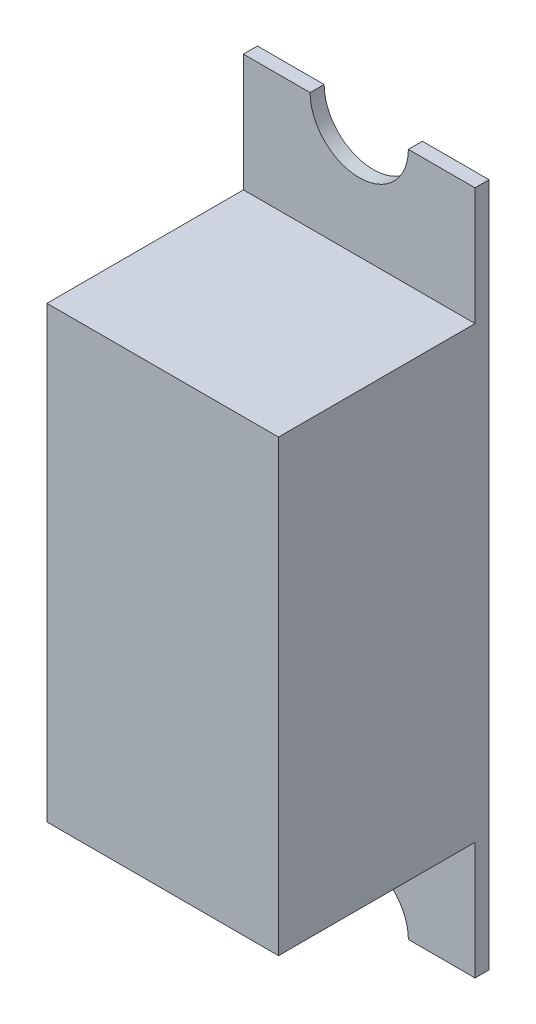
ISO-10303-21;
HEADER;
FILE_DESCRIPTION(('STEP AP214'),'2;1');
FILE_NAME('part.step','',(''),(''),'','','');
FILE_SCHEMA(('AUTOMOTIVE_DESIGN { 1 0 10303 214 1 1 1 1 }'));
ENDSEC;
DATA;
#1=APPLICATION_CONTEXT('core data for automotive mechanical design processes');
#2=APPLICATION_PROTOCOL_DEFINITION('international standard','automotive_design',2000,#1);
#3=PRODUCT_CONTEXT('',#1,'mechanical');
#4=PRODUCT('Part','Part','',(#3));
#5=PRODUCT_RELATED_PRODUCT_CATEGORY('part','',(#4));
#6=PRODUCT_DEFINITION_FORMATION('','',#4);
#7=PRODUCT_DEFINITION_CONTEXT('part definition',#1,'design');
#8=PRODUCT_DEFINITION('design','',#6,#7);
#9=PRODUCT_DEFINITION_SHAPE('','',#8);
#10=(LENGTH_UNIT() NAMED_UNIT(*) SI_UNIT(.MILLI.,.METRE.));
#11=(NAMED_UNIT(*) PLANE_ANGLE_UNIT() SI_UNIT($,.RADIAN.));
#12=(NAMED_UNIT(*) SI_UNIT($,.STERADIAN.) SOLID_ANGLE_UNIT());
#13=UNCERTAINTY_MEASURE_WITH_UNIT(LENGTH_MEASURE(1.E-05),#10,'distance_accuracy_value','');
#14=(GEOMETRIC_REPRESENTATION_CONTEXT(3) GLOBAL_UNCERTAINTY_ASSIGNED_CONTEXT((#13)) GLOBAL_UNIT_ASSIGNED_CONTEXT((#10,
#11,#12)) REPRESENTATION_CONTEXT('',''));
#15=CARTESIAN_POINT('',(0.,0.,0.));
#16=DIRECTION('',(0.,0.,1.));
#17=DIRECTION('',(1.,0.,0.));
#18=AXIS2_PLACEMENT_3D('',#15,#16,#17);
#19=CARTESIAN_POINT('',(0.,0.,5.6));
#20=DIRECTION('',(-1.,0.,0.));
#21=DIRECTION('',(0.,0.,1.));
#22=AXIS2_PLACEMENT_3D('',#19,#20,#21);
#23=PLANE('',#22);
#24=DIRECTION('',(0.,0.,-1.));
#25=VECTOR('',#24,1.);
#26=CARTESIAN_POINT('',(0.,-12.8,5.6));
#27=LINE('',#26,#25);
#28=CARTESIAN_POINT('',(0.,-12.8,5.6));
#29=VERTEX_POINT('',#28);
#30=CARTESIAN_POINT('',(0.,-12.8,0.));
#31=VERTEX_POINT('',#30);
#32=EDGE_CURVE('E164',#29,#31,#27,.T.);
#33=ORIENTED_EDGE('',*,*,#32,.T.);
#34=DIRECTION('',(0.,-1.,0.));
#35=VECTOR('',#34,1.);
#36=CARTESIAN_POINT('',(0.,0.,0.));
#37=LINE('',#36,#35);
#38=CARTESIAN_POINT('',(0.,-16.15,0.));
#39=VERTEX_POINT('',#38);
#40=EDGE_CURVE('E193',#31,#39,#37,.T.);
#41=ORIENTED_EDGE('',*,*,#40,.T.);
#42=DIRECTION('',(0.,0.,1.));
#43=VECTOR('',#42,1.);
#44=CARTESIAN_POINT('',(0.,-16.15,-0.4));
#45=LINE('',#44,#43);
#46=CARTESIAN_POINT('',(0.,-16.15,-0.4));
#47=VERTEX_POINT('',#46);
#48=EDGE_CURVE('E206',#47,#39,#45,.T.);
#49=ORIENTED_EDGE('',*,*,#48,.F.);
#50=DIRECTION('',(0.,-1.,0.));
#51=VECTOR('',#50,1.);
#52=CARTESIAN_POINT('',(0.,0.,-0.4));
#53=LINE('',#52,#51);
#54=CARTESIAN_POINT('',(0.,3.35,-0.4));
#55=VERTEX_POINT('',#54);
#56=EDGE_CURVE('E231',#55,#47,#53,.T.);
#57=ORIENTED_EDGE('',*,*,#56,.F.);
#58=DIRECTION('',(0.,0.,1.));
#59=VECTOR('',#58,1.);
#60=CARTESIAN_POINT('',(0.,3.35,-0.4));
#61=LINE('',#60,#59);
#62=CARTESIAN_POINT('',(0.,3.35,0.));
#63=VERTEX_POINT('',#62);
#64=EDGE_CURVE('E191',#55,#63,#61,.T.);
#65=ORIENTED_EDGE('',*,*,#64,.T.);
#66=CARTESIAN_POINT('',(0.,0.,0.));
#67=VERTEX_POINT('',#66);
#68=EDGE_CURVE('E185',#63,#67,#37,.T.);
#69=ORIENTED_EDGE('',*,*,#68,.T.);
#70=DIRECTION('',(0.,0.,-1.));
#71=VECTOR('',#70,1.);
#72=CARTESIAN_POINT('',(0.,0.,5.6));
#73=LINE('',#72,#71);
#74=CARTESIAN_POINT('',(0.,0.,5.6));
#75=VERTEX_POINT('',#74);
#76=EDGE_CURVE('E11',#75,#67,#73,.T.);
#77=ORIENTED_EDGE('',*,*,#76,.F.);
#78=DIRECTION('',(0.,1.,0.));
#79=VECTOR('',#78,1.);
#80=CARTESIAN_POINT('',(0.,0.,5.6));
#81=LINE('',#80,#79);
#82=EDGE_CURVE('E158',#29,#75,#81,.T.);
#83=ORIENTED_EDGE('',*,*,#82,.F.);
#84=EDGE_LOOP('',(#33,#41,#49,#57,#65,#69,#77,#83));
#85=FACE_BOUND('',#84,.T.);
#86=ADVANCED_FACE('F37',(#85),#23,.F.);
#87=CARTESIAN_POINT('',(0.,0.,5.6));
#88=DIRECTION('',(0.,-1.,0.));
#89=DIRECTION('',(1.,0.,0.));
#90=AXIS2_PLACEMENT_3D('',#87,#88,#89);
#91=PLANE('',#90);
#92=DIRECTION('',(-1.,0.,0.));
#93=VECTOR('',#92,1.);
#94=CARTESIAN_POINT('',(0.,0.,0.));
#95=LINE('',#94,#93);
#96=CARTESIAN_POINT('',(-6.6,0.,0.));
#97=VERTEX_POINT('',#96);
#98=EDGE_CURVE('E149',#67,#97,#95,.T.);
#99=ORIENTED_EDGE('',*,*,#98,.T.);
#100=DIRECTION('',(0.,0.,-1.));
#101=VECTOR('',#100,1.);
#102=CARTESIAN_POINT('',(-6.6,0.,5.6));
#103=LINE('',#102,#101);
#104=CARTESIAN_POINT('',(-6.6,0.,5.6));
#105=VERTEX_POINT('',#104);
#106=EDGE_CURVE('E45',#105,#97,#103,.T.);
#107=ORIENTED_EDGE('',*,*,#106,.F.);
#108=DIRECTION('',(-1.,0.,0.));
#109=VECTOR('',#108,1.);
#110=CARTESIAN_POINT('',(0.,0.,5.6));
#111=LINE('',#110,#109);
#112=EDGE_CURVE('E160',#75,#105,#111,.T.);
#113=ORIENTED_EDGE('',*,*,#112,.F.);
#114=ORIENTED_EDGE('',*,*,#76,.T.);
#115=EDGE_LOOP('',(#99,#107,#113,#114));
#116=FACE_BOUND('',#115,.T.);
#117=ADVANCED_FACE('F178',(#116),#91,.F.);
#118=CARTESIAN_POINT('',(-6.6,0.,5.6));
#119=DIRECTION('',(1.,0.,0.));
#120=DIRECTION('',(0.,0.,-1.));
#121=AXIS2_PLACEMENT_3D('',#118,#119,#120);
#122=PLANE('',#121);
#123=ORIENTED_EDGE('',*,*,#106,.T.);
#124=DIRECTION('',(0.,1.,0.));
#125=VECTOR('',#124,1.);
#126=CARTESIAN_POINT('',(-6.6,0.,0.));
#127=LINE('',#126,#125);
#128=CARTESIAN_POINT('',(-6.6,3.35,0.));
#129=VERTEX_POINT('',#128);
#130=EDGE_CURVE('E175',#97,#129,#127,.T.);
#131=ORIENTED_EDGE('',*,*,#130,.T.);
#132=DIRECTION('',(0.,0.,1.));
#133=VECTOR('',#132,1.);
#134=CARTESIAN_POINT('',(-6.6,3.35,-0.4));
#135=LINE('',#134,#133);
#136=CARTESIAN_POINT('',(-6.6,3.35,-0.4));
#137=VERTEX_POINT('',#136);
#138=EDGE_CURVE('E130',#137,#129,#135,.T.);
#139=ORIENTED_EDGE('',*,*,#138,.F.);
#140=DIRECTION('',(0.,1.,0.));
#141=VECTOR('',#140,1.);
#142=CARTESIAN_POINT('',(-6.6,0.,-0.4));
#143=LINE('',#142,#141);
#144=CARTESIAN_POINT('',(-6.6,-16.15,-0.4));
#145=VERTEX_POINT('',#144);
#146=EDGE_CURVE('E121',#145,#137,#143,.T.);
#147=ORIENTED_EDGE('',*,*,#146,.F.);
#148=DIRECTION('',(0.,0.,1.));
#149=VECTOR('',#148,1.);
#150=CARTESIAN_POINT('',(-6.6,-16.15,-0.4));
#151=LINE('',#150,#149);
#152=CARTESIAN_POINT('',(-6.6,-16.15,0.));
#153=VERTEX_POINT('',#152);
#154=EDGE_CURVE('E127',#145,#153,#151,.T.);
#155=ORIENTED_EDGE('',*,*,#154,.T.);
#156=CARTESIAN_POINT('',(-6.6,-12.8,0.));
#157=VERTEX_POINT('',#156);
#158=EDGE_CURVE('E223',#153,#157,#127,.T.);
#159=ORIENTED_EDGE('',*,*,#158,.T.);
#160=DIRECTION('',(0.,0.,-1.));
#161=VECTOR('',#160,1.);
#162=CARTESIAN_POINT('',(-6.6,-12.8,5.6));
#163=LINE('',#162,#161);
#164=CARTESIAN_POINT('',(-6.6,-12.8,5.6));
#165=VERTEX_POINT('',#164);
#166=EDGE_CURVE('E170',#165,#157,#163,.T.);
#167=ORIENTED_EDGE('',*,*,#166,.F.);
#168=DIRECTION('',(0.,-1.,0.));
#169=VECTOR('',#168,1.);
#170=CARTESIAN_POINT('',(-6.6,0.,5.6));
#171=LINE('',#170,#169);
#172=EDGE_CURVE('E162',#105,#165,#171,.T.);
#173=ORIENTED_EDGE('',*,*,#172,.F.);
#174=EDGE_LOOP('',(#123,#131,#139,#147,#155,#159,#167,#173));
#175=FACE_BOUND('',#174,.T.);
#176=ADVANCED_FACE('F124',(#175),#122,.F.);
#177=CARTESIAN_POINT('',(0.,-12.8,5.6));
#178=DIRECTION('',(0.,1.,0.));
#179=DIRECTION('',(0.,0.,1.));
#180=AXIS2_PLACEMENT_3D('',#177,#178,#179);
#181=PLANE('',#180);
#182=DIRECTION('',(1.,0.,0.));
#183=VECTOR('',#182,1.);
#184=CARTESIAN_POINT('',(0.,-12.8,0.));
#185=LINE('',#184,#183);
#186=EDGE_CURVE('E152',#157,#31,#185,.T.);
#187=ORIENTED_EDGE('',*,*,#186,.T.);
#188=ORIENTED_EDGE('',*,*,#32,.F.);
#189=DIRECTION('',(1.,0.,0.));
#190=VECTOR('',#189,1.);
#191=CARTESIAN_POINT('',(0.,-12.8,5.6));
#192=LINE('',#191,#190);
#193=EDGE_CURVE('E52',#165,#29,#192,.T.);
#194=ORIENTED_EDGE('',*,*,#193,.F.);
#195=ORIENTED_EDGE('',*,*,#166,.T.);
#196=EDGE_LOOP('',(#187,#188,#194,#195));
#197=FACE_BOUND('',#196,.T.);
#198=ADVANCED_FACE('F252',(#197),#181,.F.);
#199=CARTESIAN_POINT('',(0.,0.,5.6));
#200=DIRECTION('',(0.,0.,-1.));
#201=DIRECTION('',(-1.,0.,0.));
#202=AXIS2_PLACEMENT_3D('',#199,#200,#201);
#203=PLANE('',#202);
#204=ORIENTED_EDGE('',*,*,#82,.T.);
#205=ORIENTED_EDGE('',*,*,#112,.T.);
#206=ORIENTED_EDGE('',*,*,#172,.T.);
#207=ORIENTED_EDGE('',*,*,#193,.T.);
#208=EDGE_LOOP('',(#204,#205,#206,#207));
#209=FACE_BOUND('',#208,.T.);
#210=ADVANCED_FACE('F253',(#209),#203,.F.);
#211=CARTESIAN_POINT('',(0.,0.,0.));
#212=DIRECTION('',(0.,0.,-1.));
#213=DIRECTION('',(-1.,0.,0.));
#214=AXIS2_PLACEMENT_3D('',#211,#212,#213);
#215=PLANE('',#214);
#216=ORIENTED_EDGE('',*,*,#186,.F.);
#217=ORIENTED_EDGE('',*,*,#158,.F.);
#218=DIRECTION('',(-1.,0.,0.));
#219=VECTOR('',#218,1.);
#220=CARTESIAN_POINT('',(0.,-16.15,0.));
#221=LINE('',#220,#219);
#222=CARTESIAN_POINT('',(-4.7,-16.15,0.));
#223=VERTEX_POINT('',#222);
#224=EDGE_CURVE('E148',#223,#153,#221,.T.);
#225=ORIENTED_EDGE('',*,*,#224,.F.);
#226=CARTESIAN_POINT('',(-3.3,-16.15,0.));
#227=DIRECTION('',(0.,0.,-1.));
#228=DIRECTION('',(-1.,0.,0.));
#229=AXIS2_PLACEMENT_3D('',#226,#227,#228);
#230=CIRCLE('',#229,1.4);
#231=CARTESIAN_POINT('',(-1.9,-16.15,0.));
#232=VERTEX_POINT('',#231);
#233=EDGE_CURVE('E144',#232,#223,#230,.F.);
#234=ORIENTED_EDGE('',*,*,#233,.F.);
#235=DIRECTION('',(-1.,0.,0.));
#236=VECTOR('',#235,1.);
#237=CARTESIAN_POINT('',(0.,-16.15,0.));
#238=LINE('',#237,#236);
#239=EDGE_CURVE('E192',#39,#232,#238,.T.);
#240=ORIENTED_EDGE('',*,*,#239,.F.);
#241=ORIENTED_EDGE('',*,*,#40,.F.);
#242=EDGE_LOOP('',(#216,#217,#225,#234,#240,#241));
#243=FACE_BOUND('',#242,.T.);
#244=ADVANCED_FACE('F250',(#243),#215,.F.);
#245=CARTESIAN_POINT('',(0.,-16.15,-0.4));
#246=DIRECTION('',(0.,1.,0.));
#247=DIRECTION('',(0.,0.,1.));
#248=AXIS2_PLACEMENT_3D('',#245,#246,#247);
#249=PLANE('',#248);
#250=ORIENTED_EDGE('',*,*,#224,.T.);
#251=ORIENTED_EDGE('',*,*,#154,.F.);
#252=DIRECTION('',(-1.,0.,0.));
#253=VECTOR('',#252,1.);
#254=CARTESIAN_POINT('',(0.,-16.15,-0.4));
#255=LINE('',#254,#253);
#256=CARTESIAN_POINT('',(-4.7,-16.15,-0.4));
#257=VERTEX_POINT('',#256);
#258=EDGE_CURVE('E135',#257,#145,#255,.T.);
#259=ORIENTED_EDGE('',*,*,#258,.F.);
#260=DIRECTION('',(0.,0.,1.));
#261=VECTOR('',#260,1.);
#262=CARTESIAN_POINT('',(-4.7,-16.15,-0.4));
#263=LINE('',#262,#261);
#264=EDGE_CURVE('E201',#257,#223,#263,.T.);
#265=ORIENTED_EDGE('',*,*,#264,.T.);
#266=EDGE_LOOP('',(#250,#251,#259,#265));
#267=FACE_BOUND('',#266,.T.);
#268=ADVANCED_FACE('F146',(#267),#249,.F.);
#269=CARTESIAN_POINT('',(0.,3.35,-0.4));
#270=DIRECTION('',(0.,1.,0.));
#271=DIRECTION('',(0.,0.,1.));
#272=AXIS2_PLACEMENT_3D('',#269,#270,#271);
#273=PLANE('',#272);
#274=DIRECTION('',(-1.,0.,0.));
#275=VECTOR('',#274,1.);
#276=CARTESIAN_POINT('',(0.,3.35,0.));
#277=LINE('',#276,#275);
#278=CARTESIAN_POINT('',(-4.7,3.35,0.));
#279=VERTEX_POINT('',#278);
#280=EDGE_CURVE('E221',#279,#129,#277,.T.);
#281=ORIENTED_EDGE('',*,*,#280,.F.);
#282=DIRECTION('',(0.,0.,1.));
#283=VECTOR('',#282,1.);
#284=CARTESIAN_POINT('',(-4.7,3.35,-0.4));
#285=LINE('',#284,#283);
#286=CARTESIAN_POINT('',(-4.7,3.35,-0.4));
#287=VERTEX_POINT('',#286);
#288=EDGE_CURVE('E154',#287,#279,#285,.T.);
#289=ORIENTED_EDGE('',*,*,#288,.F.);
#290=DIRECTION('',(-1.,0.,0.));
#291=VECTOR('',#290,1.);
#292=CARTESIAN_POINT('',(0.,3.35,-0.4));
#293=LINE('',#292,#291);
#294=EDGE_CURVE('E134',#287,#137,#293,.T.);
#295=ORIENTED_EDGE('',*,*,#294,.T.);
#296=ORIENTED_EDGE('',*,*,#138,.T.);
#297=EDGE_LOOP('',(#281,#289,#295,#296));
#298=FACE_BOUND('',#297,.T.);
#299=ADVANCED_FACE('F222',(#298),#273,.T.);
#300=CARTESIAN_POINT('',(-3.3,3.35,-0.4));
#301=DIRECTION('',(0.,0.,1.));
#302=DIRECTION('',(1.,0.,0.));
#303=AXIS2_PLACEMENT_3D('',#300,#301,#302);
#304=CYLINDRICAL_SURFACE('',#303,1.4);
#305=CARTESIAN_POINT('',(-3.3,3.35,0.));
#306=DIRECTION('',(0.,0.,-1.));
#307=DIRECTION('',(-1.,0.,0.));
#308=AXIS2_PLACEMENT_3D('',#305,#306,#307);
#309=CIRCLE('',#308,1.4);
#310=CARTESIAN_POINT('',(-1.9,3.35,0.));
#311=VERTEX_POINT('',#310);
#312=EDGE_CURVE('E217',#311,#279,#309,.T.);
#313=ORIENTED_EDGE('',*,*,#312,.F.);
#314=DIRECTION('',(0.,0.,1.));
#315=VECTOR('',#314,1.);
#316=CARTESIAN_POINT('',(-1.9,3.35,-0.4));
#317=LINE('',#316,#315);
#318=CARTESIAN_POINT('',(-1.9,3.35,-0.4));
#319=VERTEX_POINT('',#318);
#320=EDGE_CURVE('E210',#319,#311,#317,.T.);
#321=ORIENTED_EDGE('',*,*,#320,.F.);
#322=CARTESIAN_POINT('',(-3.3,3.35,-0.4));
#323=DIRECTION('',(0.,0.,-1.));
#324=DIRECTION('',(-1.,0.,0.));
#325=AXIS2_PLACEMENT_3D('',#322,#323,#324);
#326=CIRCLE('',#325,1.4);
#327=EDGE_CURVE('E219',#319,#287,#326,.T.);
#328=ORIENTED_EDGE('',*,*,#327,.T.);
#329=ORIENTED_EDGE('',*,*,#288,.T.);
#330=EDGE_LOOP('',(#313,#321,#328,#329));
#331=FACE_BOUND('',#330,.T.);
#332=ADVANCED_FACE('F215',(#331),#304,.F.);
#333=CARTESIAN_POINT('',(0.,3.35,-0.4));
#334=DIRECTION('',(0.,1.,0.));
#335=DIRECTION('',(0.,0.,1.));
#336=AXIS2_PLACEMENT_3D('',#333,#334,#335);
#337=PLANE('',#336);
#338=DIRECTION('',(-1.,0.,0.));
#339=VECTOR('',#338,1.);
#340=CARTESIAN_POINT('',(0.,3.35,0.));
#341=LINE('',#340,#339);
#342=EDGE_CURVE('E196',#63,#311,#341,.T.);
#343=ORIENTED_EDGE('',*,*,#342,.F.);
#344=ORIENTED_EDGE('',*,*,#64,.F.);
#345=DIRECTION('',(-1.,0.,0.));
#346=VECTOR('',#345,1.);
#347=CARTESIAN_POINT('',(0.,3.35,-0.4));
#348=LINE('',#347,#346);
#349=EDGE_CURVE('E233',#55,#319,#348,.T.);
#350=ORIENTED_EDGE('',*,*,#349,.T.);
#351=ORIENTED_EDGE('',*,*,#320,.T.);
#352=EDGE_LOOP('',(#343,#344,#350,#351));
#353=FACE_BOUND('',#352,.T.);
#354=ADVANCED_FACE('F239',(#353),#337,.T.);
#355=CARTESIAN_POINT('',(0.,-16.15,-0.4));
#356=DIRECTION('',(0.,1.,0.));
#357=DIRECTION('',(0.,0.,1.));
#358=AXIS2_PLACEMENT_3D('',#355,#356,#357);
#359=PLANE('',#358);
#360=ORIENTED_EDGE('',*,*,#239,.T.);
#361=DIRECTION('',(0.,0.,1.));
#362=VECTOR('',#361,1.);
#363=CARTESIAN_POINT('',(-1.9,-16.15,-0.4));
#364=LINE('',#363,#362);
#365=CARTESIAN_POINT('',(-1.9,-16.15,-0.4));
#366=VERTEX_POINT('',#365);
#367=EDGE_CURVE('E203',#366,#232,#364,.T.);
#368=ORIENTED_EDGE('',*,*,#367,.F.);
#369=DIRECTION('',(-1.,0.,0.));
#370=VECTOR('',#369,1.);
#371=CARTESIAN_POINT('',(0.,-16.15,-0.4));
#372=LINE('',#371,#370);
#373=EDGE_CURVE('E229',#47,#366,#372,.T.);
#374=ORIENTED_EDGE('',*,*,#373,.F.);
#375=ORIENTED_EDGE('',*,*,#48,.T.);
#376=EDGE_LOOP('',(#360,#368,#374,#375));
#377=FACE_BOUND('',#376,.T.);
#378=ADVANCED_FACE('F244',(#377),#359,.F.);
#379=CARTESIAN_POINT('',(-3.3,-16.15,-0.4));
#380=DIRECTION('',(0.,0.,1.));
#381=DIRECTION('',(1.,0.,0.));
#382=AXIS2_PLACEMENT_3D('',#379,#380,#381);
#383=CYLINDRICAL_SURFACE('',#382,1.4);
#384=ORIENTED_EDGE('',*,*,#233,.T.);
#385=ORIENTED_EDGE('',*,*,#264,.F.);
#386=CARTESIAN_POINT('',(-3.3,-16.15,-0.4));
#387=DIRECTION('',(0.,0.,-1.));
#388=DIRECTION('',(-1.,0.,0.));
#389=AXIS2_PLACEMENT_3D('',#386,#387,#388);
#390=CIRCLE('',#389,1.4);
#391=EDGE_CURVE('E140',#366,#257,#390,.F.);
#392=ORIENTED_EDGE('',*,*,#391,.F.);
#393=ORIENTED_EDGE('',*,*,#367,.T.);
#394=EDGE_LOOP('',(#384,#385,#392,#393));
#395=FACE_BOUND('',#394,.T.);
#396=ADVANCED_FACE('F248',(#395),#383,.F.);
#397=CARTESIAN_POINT('',(0.,0.,-0.4));
#398=DIRECTION('',(0.,0.,-1.));
#399=DIRECTION('',(-1.,0.,0.));
#400=AXIS2_PLACEMENT_3D('',#397,#398,#399);
#401=PLANE('',#400);
#402=ORIENTED_EDGE('',*,*,#258,.T.);
#403=ORIENTED_EDGE('',*,*,#146,.T.);
#404=ORIENTED_EDGE('',*,*,#294,.F.);
#405=ORIENTED_EDGE('',*,*,#327,.F.);
#406=ORIENTED_EDGE('',*,*,#349,.F.);
#407=ORIENTED_EDGE('',*,*,#56,.T.);
#408=ORIENTED_EDGE('',*,*,#373,.T.);
#409=ORIENTED_EDGE('',*,*,#391,.T.);
#410=EDGE_LOOP('',(#402,#403,#404,#405,#406,#407,#408,#409));
#411=FACE_BOUND('',#410,.T.);
#412=ADVANCED_FACE('F138',(#411),#401,.T.);
#413=ORIENTED_EDGE('',*,*,#98,.F.);
#414=ORIENTED_EDGE('',*,*,#68,.F.);
#415=ORIENTED_EDGE('',*,*,#342,.T.);
#416=ORIENTED_EDGE('',*,*,#312,.T.);
#417=ORIENTED_EDGE('',*,*,#280,.T.);
#418=ORIENTED_EDGE('',*,*,#130,.F.);
#419=EDGE_LOOP('',(#413,#414,#415,#416,#417,#418));
#420=FACE_BOUND('',#419,.T.);
#421=ADVANCED_FACE('F183',(#420),#215,.F.);
#422=CLOSED_SHELL('',(#86,#117,#176,#198,#210,#244,#268,#299,#332,#354,#378,#396,#412,#421));
#423=MANIFOLD_SOLID_BREP('B2',#422);
#424=ADVANCED_BREP_SHAPE_REPRESENTATION('',(#18,#423),#14);
#425=SHAPE_DEFINITION_REPRESENTATION(#9,#424);
ENDSEC;
END-ISO-10303-21;
